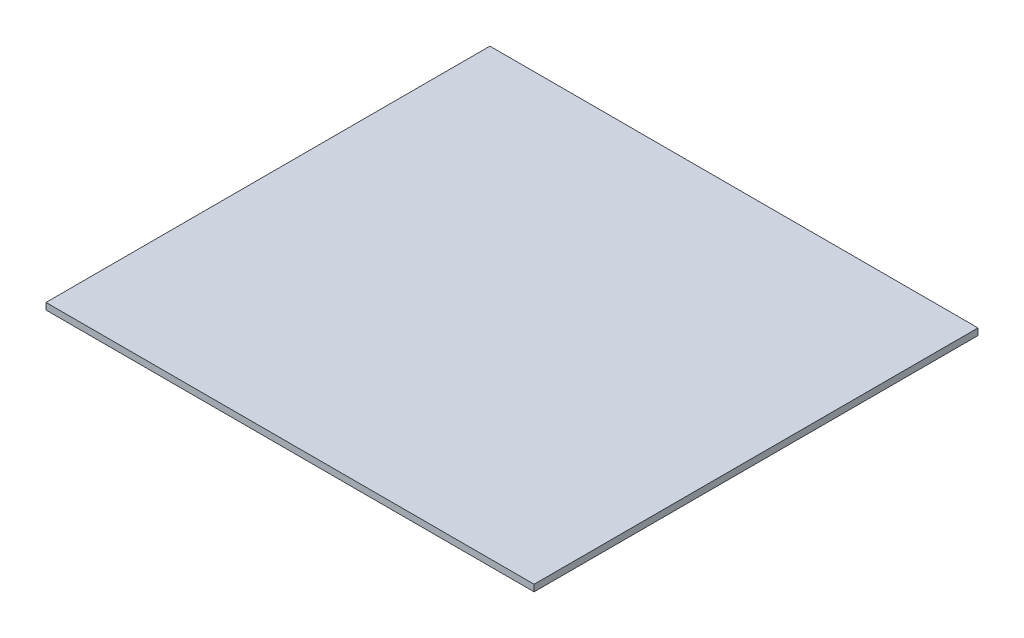
ISO-10303-21;
HEADER;
FILE_DESCRIPTION(('STEP AP214'),'2;1');
FILE_NAME('part.step','',(''),(''),'','','');
FILE_SCHEMA(('AUTOMOTIVE_DESIGN { 1 0 10303 214 1 1 1 1 }'));
ENDSEC;
DATA;
#1=APPLICATION_CONTEXT('core data for automotive mechanical design processes');
#2=APPLICATION_PROTOCOL_DEFINITION('international standard','automotive_design',2000,#1);
#3=PRODUCT_CONTEXT('',#1,'mechanical');
#4=PRODUCT('Part','Part','',(#3));
#5=PRODUCT_RELATED_PRODUCT_CATEGORY('part','',(#4));
#6=PRODUCT_DEFINITION_FORMATION('','',#4);
#7=PRODUCT_DEFINITION_CONTEXT('part definition',#1,'design');
#8=PRODUCT_DEFINITION('design','',#6,#7);
#9=PRODUCT_DEFINITION_SHAPE('','',#8);
#10=(LENGTH_UNIT() NAMED_UNIT(*) SI_UNIT(.MILLI.,.METRE.));
#11=(NAMED_UNIT(*) PLANE_ANGLE_UNIT() SI_UNIT($,.RADIAN.));
#12=(NAMED_UNIT(*) SI_UNIT($,.STERADIAN.) SOLID_ANGLE_UNIT());
#13=UNCERTAINTY_MEASURE_WITH_UNIT(LENGTH_MEASURE(1.E-05),#10,'distance_accuracy_value','');
#14=(GEOMETRIC_REPRESENTATION_CONTEXT(3) GLOBAL_UNCERTAINTY_ASSIGNED_CONTEXT((#13)) GLOBAL_UNIT_ASSIGNED_CONTEXT((#10,
#11,#12)) REPRESENTATION_CONTEXT('',''));
#15=CARTESIAN_POINT('',(0.,0.,0.));
#16=DIRECTION('',(0.,0.,1.));
#17=DIRECTION('',(1.,0.,0.));
#18=AXIS2_PLACEMENT_3D('',#15,#16,#17);
#19=CARTESIAN_POINT('',(110.5,3.,100.5));
#20=DIRECTION('',(-1.,0.,0.));
#21=DIRECTION('',(0.,0.,1.));
#22=AXIS2_PLACEMENT_3D('',#19,#20,#21);
#23=PLANE('',#22);
#24=DIRECTION('',(0.,0.,-1.));
#25=VECTOR('',#24,1.);
#26=CARTESIAN_POINT('',(110.5,0.,100.5));
#27=LINE('',#26,#25);
#28=CARTESIAN_POINT('',(110.5,0.,100.5));
#29=VERTEX_POINT('',#28);
#30=CARTESIAN_POINT('',(110.5,0.,-100.5));
#31=VERTEX_POINT('',#30);
#32=EDGE_CURVE('E107',#29,#31,#27,.T.);
#33=ORIENTED_EDGE('',*,*,#32,.T.);
#34=DIRECTION('',(0.,-1.,0.));
#35=VECTOR('',#34,1.);
#36=CARTESIAN_POINT('',(110.5,3.,-100.5));
#37=LINE('',#36,#35);
#38=CARTESIAN_POINT('',(110.5,3.,-100.5));
#39=VERTEX_POINT('',#38);
#40=EDGE_CURVE('E11',#39,#31,#37,.T.);
#41=ORIENTED_EDGE('',*,*,#40,.F.);
#42=DIRECTION('',(0.,0.,-1.));
#43=VECTOR('',#42,1.);
#44=CARTESIAN_POINT('',(110.5,3.,100.5));
#45=LINE('',#44,#43);
#46=CARTESIAN_POINT('',(110.5,3.,100.5));
#47=VERTEX_POINT('',#46);
#48=EDGE_CURVE('E91',#47,#39,#45,.T.);
#49=ORIENTED_EDGE('',*,*,#48,.F.);
#50=DIRECTION('',(0.,-1.,0.));
#51=VECTOR('',#50,1.);
#52=CARTESIAN_POINT('',(110.5,3.,100.5));
#53=LINE('',#52,#51);
#54=EDGE_CURVE('E103',#47,#29,#53,.T.);
#55=ORIENTED_EDGE('',*,*,#54,.T.);
#56=EDGE_LOOP('',(#33,#41,#49,#55));
#57=FACE_BOUND('',#56,.T.);
#58=ADVANCED_FACE('F39',(#57),#23,.F.);
#59=CARTESIAN_POINT('',(-110.5,3.,-100.5));
#60=DIRECTION('',(0.,0.,1.));
#61=DIRECTION('',(1.,0.,0.));
#62=AXIS2_PLACEMENT_3D('',#59,#60,#61);
#63=PLANE('',#62);
#64=DIRECTION('',(-1.,0.,0.));
#65=VECTOR('',#64,1.);
#66=CARTESIAN_POINT('',(-110.5,0.,-100.5));
#67=LINE('',#66,#65);
#68=CARTESIAN_POINT('',(-110.5,0.,-100.5));
#69=VERTEX_POINT('',#68);
#70=EDGE_CURVE('E96',#31,#69,#67,.T.);
#71=ORIENTED_EDGE('',*,*,#70,.T.);
#72=DIRECTION('',(0.,-1.,0.));
#73=VECTOR('',#72,1.);
#74=CARTESIAN_POINT('',(-110.5,3.,-100.5));
#75=LINE('',#74,#73);
#76=CARTESIAN_POINT('',(-110.5,3.,-100.5));
#77=VERTEX_POINT('',#76);
#78=EDGE_CURVE('E48',#77,#69,#75,.T.);
#79=ORIENTED_EDGE('',*,*,#78,.F.);
#80=DIRECTION('',(-1.,0.,0.));
#81=VECTOR('',#80,1.);
#82=CARTESIAN_POINT('',(-110.5,3.,-100.5));
#83=LINE('',#82,#81);
#84=EDGE_CURVE('E86',#39,#77,#83,.T.);
#85=ORIENTED_EDGE('',*,*,#84,.F.);
#86=ORIENTED_EDGE('',*,*,#40,.T.);
#87=EDGE_LOOP('',(#71,#79,#85,#86));
#88=FACE_BOUND('',#87,.T.);
#89=ADVANCED_FACE('F95',(#88),#63,.F.);
#90=CARTESIAN_POINT('',(-110.5,3.,100.5));
#91=DIRECTION('',(1.,0.,0.));
#92=DIRECTION('',(0.,0.,-1.));
#93=AXIS2_PLACEMENT_3D('',#90,#91,#92);
#94=PLANE('',#93);
#95=DIRECTION('',(0.,0.,1.));
#96=VECTOR('',#95,1.);
#97=CARTESIAN_POINT('',(-110.5,0.,100.5));
#98=LINE('',#97,#96);
#99=CARTESIAN_POINT('',(-110.5,0.,100.5));
#100=VERTEX_POINT('',#99);
#101=EDGE_CURVE('E73',#69,#100,#98,.T.);
#102=ORIENTED_EDGE('',*,*,#101,.T.);
#103=DIRECTION('',(0.,-1.,0.));
#104=VECTOR('',#103,1.);
#105=CARTESIAN_POINT('',(-110.5,3.,100.5));
#106=LINE('',#105,#104);
#107=CARTESIAN_POINT('',(-110.5,3.,100.5));
#108=VERTEX_POINT('',#107);
#109=EDGE_CURVE('E98',#108,#100,#106,.T.);
#110=ORIENTED_EDGE('',*,*,#109,.F.);
#111=DIRECTION('',(0.,0.,1.));
#112=VECTOR('',#111,1.);
#113=CARTESIAN_POINT('',(-110.5,3.,100.5));
#114=LINE('',#113,#112);
#115=EDGE_CURVE('E89',#77,#108,#114,.T.);
#116=ORIENTED_EDGE('',*,*,#115,.F.);
#117=ORIENTED_EDGE('',*,*,#78,.T.);
#118=EDGE_LOOP('',(#102,#110,#116,#117));
#119=FACE_BOUND('',#118,.T.);
#120=ADVANCED_FACE('F99',(#119),#94,.F.);
#121=CARTESIAN_POINT('',(-110.5,3.,100.5));
#122=DIRECTION('',(0.,0.,-1.));
#123=DIRECTION('',(-1.,0.,0.));
#124=AXIS2_PLACEMENT_3D('',#121,#122,#123);
#125=PLANE('',#124);
#126=DIRECTION('',(1.,0.,0.));
#127=VECTOR('',#126,1.);
#128=CARTESIAN_POINT('',(-110.5,0.,100.5));
#129=LINE('',#128,#127);
#130=EDGE_CURVE('E79',#100,#29,#129,.T.);
#131=ORIENTED_EDGE('',*,*,#130,.T.);
#132=ORIENTED_EDGE('',*,*,#54,.F.);
#133=DIRECTION('',(1.,0.,0.));
#134=VECTOR('',#133,1.);
#135=CARTESIAN_POINT('',(-110.5,3.,100.5));
#136=LINE('',#135,#134);
#137=EDGE_CURVE('E56',#108,#47,#136,.T.);
#138=ORIENTED_EDGE('',*,*,#137,.F.);
#139=ORIENTED_EDGE('',*,*,#109,.T.);
#140=EDGE_LOOP('',(#131,#132,#138,#139));
#141=FACE_BOUND('',#140,.T.);
#142=ADVANCED_FACE('F120',(#141),#125,.F.);
#143=CARTESIAN_POINT('',(0.,3.,0.));
#144=DIRECTION('',(0.,-1.,0.));
#145=DIRECTION('',(0.,0.,-1.));
#146=AXIS2_PLACEMENT_3D('',#143,#144,#145);
#147=PLANE('',#146);
#148=ORIENTED_EDGE('',*,*,#48,.T.);
#149=ORIENTED_EDGE('',*,*,#84,.T.);
#150=ORIENTED_EDGE('',*,*,#115,.T.);
#151=ORIENTED_EDGE('',*,*,#137,.T.);
#152=EDGE_LOOP('',(#148,#149,#150,#151));
#153=FACE_BOUND('',#152,.T.);
#154=ADVANCED_FACE('F87',(#153),#147,.F.);
#155=CARTESIAN_POINT('',(0.,0.,0.));
#156=DIRECTION('',(0.,-1.,0.));
#157=DIRECTION('',(0.,0.,-1.));
#158=AXIS2_PLACEMENT_3D('',#155,#156,#157);
#159=PLANE('',#158);
#160=ORIENTED_EDGE('',*,*,#32,.F.);
#161=ORIENTED_EDGE('',*,*,#130,.F.);
#162=ORIENTED_EDGE('',*,*,#101,.F.);
#163=ORIENTED_EDGE('',*,*,#70,.F.);
#164=EDGE_LOOP('',(#160,#161,#162,#163));
#165=FACE_BOUND('',#164,.T.);
#166=ADVANCED_FACE('F123',(#165),#159,.T.);
#167=CLOSED_SHELL('',(#58,#89,#120,#142,#154,#166));
#168=MANIFOLD_SOLID_BREP('B2',#167);
#169=ADVANCED_BREP_SHAPE_REPRESENTATION('',(#18,#168),#14);
#170=SHAPE_DEFINITION_REPRESENTATION(#9,#169);
ENDSEC;
END-ISO-10303-21;
